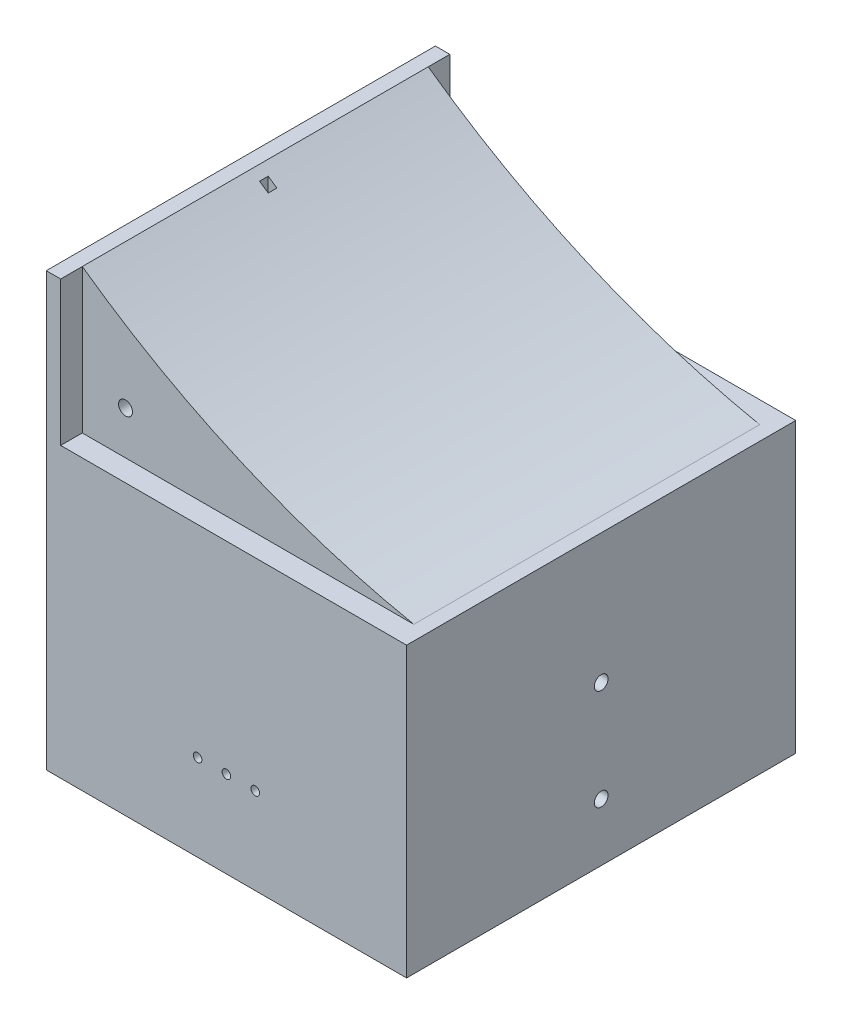
ISO-10303-21;
HEADER;
FILE_DESCRIPTION(('STEP AP214'),'2;1');
FILE_NAME('part.step','',(''),(''),'','','');
FILE_SCHEMA(('AUTOMOTIVE_DESIGN { 1 0 10303 214 1 1 1 1 }'));
ENDSEC;
DATA;
#1=APPLICATION_CONTEXT('core data for automotive mechanical design processes');
#2=APPLICATION_PROTOCOL_DEFINITION('international standard','automotive_design',2000,#1);
#3=PRODUCT_CONTEXT('',#1,'mechanical');
#4=PRODUCT('Part','Part','',(#3));
#5=PRODUCT_RELATED_PRODUCT_CATEGORY('part','',(#4));
#6=PRODUCT_DEFINITION_FORMATION('','',#4);
#7=PRODUCT_DEFINITION_CONTEXT('part definition',#1,'design');
#8=PRODUCT_DEFINITION('design','',#6,#7);
#9=PRODUCT_DEFINITION_SHAPE('','',#8);
#10=(LENGTH_UNIT() NAMED_UNIT(*) SI_UNIT(.MILLI.,.METRE.));
#11=(NAMED_UNIT(*) PLANE_ANGLE_UNIT() SI_UNIT($,.RADIAN.));
#12=(NAMED_UNIT(*) SI_UNIT($,.STERADIAN.) SOLID_ANGLE_UNIT());
#13=UNCERTAINTY_MEASURE_WITH_UNIT(LENGTH_MEASURE(1.E-05),#10,'distance_accuracy_value','');
#14=(GEOMETRIC_REPRESENTATION_CONTEXT(3) GLOBAL_UNCERTAINTY_ASSIGNED_CONTEXT((#13)) GLOBAL_UNIT_ASSIGNED_CONTEXT((#10,
#11,#12)) REPRESENTATION_CONTEXT('',''));
#15=CARTESIAN_POINT('',(0.,0.,0.));
#16=DIRECTION('',(0.,0.,1.));
#17=DIRECTION('',(1.,0.,0.));
#18=AXIS2_PLACEMENT_3D('',#15,#16,#17);
#19=CARTESIAN_POINT('',(0.,0.,60.));
#20=DIRECTION('',(0.,1.,0.));
#21=DIRECTION('',(0.,0.,1.));
#22=AXIS2_PLACEMENT_3D('',#19,#20,#21);
#23=PLANE('',#22);
#24=DIRECTION('',(0.,0.,1.));
#25=VECTOR('',#24,1.);
#26=CARTESIAN_POINT('',(-5.,0.,-67.5));
#27=LINE('',#26,#25);
#28=CARTESIAN_POINT('',(-5.,0.,37.5));
#29=VERTEX_POINT('',#28);
#30=CARTESIAN_POINT('',(-5.,0.,67.5));
#31=VERTEX_POINT('',#30);
#32=EDGE_CURVE('E296',#29,#31,#27,.T.);
#33=ORIENTED_EDGE('',*,*,#32,.F.);
#34=DIRECTION('',(-1.,0.,0.));
#35=VECTOR('',#34,1.);
#36=CARTESIAN_POINT('',(-5.,0.,37.5));
#37=LINE('',#36,#35);
#38=CARTESIAN_POINT('',(107.3,0.,37.5));
#39=VERTEX_POINT('',#38);
#40=EDGE_CURVE('E269',#39,#29,#37,.T.);
#41=ORIENTED_EDGE('',*,*,#40,.F.);
#42=DIRECTION('',(0.,0.,1.));
#43=VECTOR('',#42,1.);
#44=CARTESIAN_POINT('',(107.3,0.,37.5));
#45=LINE('',#44,#43);
#46=CARTESIAN_POINT('',(107.3,0.,-37.5));
#47=VERTEX_POINT('',#46);
#48=EDGE_CURVE('E280',#47,#39,#45,.T.);
#49=ORIENTED_EDGE('',*,*,#48,.F.);
#50=DIRECTION('',(1.,0.,0.));
#51=VECTOR('',#50,1.);
#52=CARTESIAN_POINT('',(-5.,0.,-37.5));
#53=LINE('',#52,#51);
#54=CARTESIAN_POINT('',(-5.,0.,-37.5));
#55=VERTEX_POINT('',#54);
#56=EDGE_CURVE('E264',#55,#47,#53,.T.);
#57=ORIENTED_EDGE('',*,*,#56,.F.);
#58=CARTESIAN_POINT('',(-5.,0.,-67.5));
#59=VERTEX_POINT('',#58);
#60=EDGE_CURVE('E298',#59,#55,#27,.T.);
#61=ORIENTED_EDGE('',*,*,#60,.F.);
#62=DIRECTION('',(1.,0.,0.));
#63=VECTOR('',#62,1.);
#64=CARTESIAN_POINT('',(0.,0.,-67.5));
#65=LINE('',#64,#63);
#66=CARTESIAN_POINT('',(120.,0.,-67.5));
#67=VERTEX_POINT('',#66);
#68=EDGE_CURVE('E324',#59,#67,#65,.T.);
#69=ORIENTED_EDGE('',*,*,#68,.T.);
#70=DIRECTION('',(0.,0.,-1.));
#71=VECTOR('',#70,1.);
#72=CARTESIAN_POINT('',(120.,0.,60.));
#73=LINE('',#72,#71);
#74=CARTESIAN_POINT('',(120.,0.,67.5));
#75=VERTEX_POINT('',#74);
#76=EDGE_CURVE('E44',#75,#67,#73,.T.);
#77=ORIENTED_EDGE('',*,*,#76,.F.);
#78=DIRECTION('',(1.,0.,0.));
#79=VECTOR('',#78,1.);
#80=CARTESIAN_POINT('',(0.,0.,67.5));
#81=LINE('',#80,#79);
#82=EDGE_CURVE('E330',#31,#75,#81,.T.);
#83=ORIENTED_EDGE('',*,*,#82,.F.);
#84=EDGE_LOOP('',(#33,#41,#49,#57,#61,#69,#77,#83));
#85=FACE_BOUND('',#84,.T.);
#86=ADVANCED_FACE('F41',(#85),#23,.F.);
#87=CARTESIAN_POINT('',(120.,0.,60.));
#88=DIRECTION('',(-1.,0.,0.));
#89=DIRECTION('',(0.,0.,1.));
#90=AXIS2_PLACEMENT_3D('',#87,#88,#89);
#91=PLANE('',#90);
#92=CARTESIAN_POINT('',(120.,55.,0.));
#93=DIRECTION('',(-1.,0.,0.));
#94=DIRECTION('',(0.,0.,1.));
#95=AXIS2_PLACEMENT_3D('',#92,#93,#94);
#96=CIRCLE('',#95,2.38759999999998);
#97=CARTESIAN_POINT('',(120.,55.,2.38759999999998));
#98=VERTEX_POINT('',#97);
#99=EDGE_CURVE('E255',#98,#98,#96,.T.);
#100=ORIENTED_EDGE('',*,*,#99,.T.);
#101=EDGE_LOOP('',(#100));
#102=FACE_BOUND('',#101,.T.);
#103=CARTESIAN_POINT('',(120.,20.,0.));
#104=DIRECTION('',(-1.,0.,0.));
#105=DIRECTION('',(0.,0.,1.));
#106=AXIS2_PLACEMENT_3D('',#103,#104,#105);
#107=CIRCLE('',#106,2.38759999999999);
#108=CARTESIAN_POINT('',(120.,20.,2.38759999999999));
#109=VERTEX_POINT('',#108);
#110=EDGE_CURVE('E261',#109,#109,#107,.T.);
#111=ORIENTED_EDGE('',*,*,#110,.T.);
#112=EDGE_LOOP('',(#111));
#113=FACE_BOUND('',#112,.T.);
#114=ORIENTED_EDGE('',*,*,#76,.T.);
#115=DIRECTION('',(0.,1.,0.));
#116=VECTOR('',#115,1.);
#117=CARTESIAN_POINT('',(120.,0.,-67.5));
#118=LINE('',#117,#116);
#119=CARTESIAN_POINT('',(120.,100.,-67.5));
#120=VERTEX_POINT('',#119);
#121=EDGE_CURVE('E321',#67,#120,#118,.T.);
#122=ORIENTED_EDGE('',*,*,#121,.T.);
#123=DIRECTION('',(0.,0.,-1.));
#124=VECTOR('',#123,1.);
#125=CARTESIAN_POINT('',(120.,100.,60.));
#126=LINE('',#125,#124);
#127=CARTESIAN_POINT('',(120.,100.,67.5));
#128=VERTEX_POINT('',#127);
#129=EDGE_CURVE('E359',#128,#120,#126,.T.);
#130=ORIENTED_EDGE('',*,*,#129,.F.);
#131=DIRECTION('',(0.,1.,0.));
#132=VECTOR('',#131,1.);
#133=CARTESIAN_POINT('',(120.,0.,67.5));
#134=LINE('',#133,#132);
#135=EDGE_CURVE('E333',#75,#128,#134,.T.);
#136=ORIENTED_EDGE('',*,*,#135,.F.);
#137=EDGE_LOOP('',(#114,#122,#130,#136));
#138=FACE_BOUND('',#137,.T.);
#139=ADVANCED_FACE('F366',(#102,#113,#138),#91,.F.);
#140=CARTESIAN_POINT('',(120.,100.,60.));
#141=DIRECTION('',(0.,-1.,0.));
#142=DIRECTION('',(0.,0.,-1.));
#143=AXIS2_PLACEMENT_3D('',#140,#141,#142);
#144=PLANE('',#143);
#145=ORIENTED_EDGE('',*,*,#129,.T.);
#146=DIRECTION('',(-1.,0.,0.));
#147=VECTOR('',#146,1.);
#148=CARTESIAN_POINT('',(0.,100.,-67.5));
#149=LINE('',#148,#147);
#150=CARTESIAN_POINT('',(0.,100.,-67.5));
#151=VERTEX_POINT('',#150);
#152=EDGE_CURVE('E318',#120,#151,#149,.T.);
#153=ORIENTED_EDGE('',*,*,#152,.T.);
#154=DIRECTION('',(0.,0.,1.));
#155=VECTOR('',#154,1.);
#156=CARTESIAN_POINT('',(0.,100.,-67.5));
#157=LINE('',#156,#155);
#158=CARTESIAN_POINT('',(0.,100.,-60.));
#159=VERTEX_POINT('',#158);
#160=EDGE_CURVE('E326',#151,#159,#157,.T.);
#161=ORIENTED_EDGE('',*,*,#160,.T.);
#162=DIRECTION('',(-1.,0.,0.));
#163=VECTOR('',#162,1.);
#164=CARTESIAN_POINT('',(0.,100.,-60.));
#165=LINE('',#164,#163);
#166=CARTESIAN_POINT('',(115.,100.,-60.));
#167=VERTEX_POINT('',#166);
#168=EDGE_CURVE('E12',#167,#159,#165,.T.);
#169=ORIENTED_EDGE('',*,*,#168,.F.);
#170=DIRECTION('',(0.,0.,-1.));
#171=VECTOR('',#170,1.);
#172=CARTESIAN_POINT('',(115.,100.,60.));
#173=LINE('',#172,#171);
#174=CARTESIAN_POINT('',(115.,100.,60.));
#175=VERTEX_POINT('',#174);
#176=EDGE_CURVE('E357',#175,#167,#173,.T.);
#177=ORIENTED_EDGE('',*,*,#176,.F.);
#178=DIRECTION('',(-1.,0.,0.));
#179=VECTOR('',#178,1.);
#180=CARTESIAN_POINT('',(0.,100.,60.));
#181=LINE('',#180,#179);
#182=CARTESIAN_POINT('',(0.,100.,60.));
#183=VERTEX_POINT('',#182);
#184=EDGE_CURVE('E49',#175,#183,#181,.T.);
#185=ORIENTED_EDGE('',*,*,#184,.T.);
#186=DIRECTION('',(0.,0.,-1.));
#187=VECTOR('',#186,1.);
#188=CARTESIAN_POINT('',(0.,100.,67.5));
#189=LINE('',#188,#187);
#190=CARTESIAN_POINT('',(0.,100.,67.5));
#191=VERTEX_POINT('',#190);
#192=EDGE_CURVE('E339',#191,#183,#189,.T.);
#193=ORIENTED_EDGE('',*,*,#192,.F.);
#194=DIRECTION('',(-1.,0.,0.));
#195=VECTOR('',#194,1.);
#196=CARTESIAN_POINT('',(0.,100.,67.5));
#197=LINE('',#196,#195);
#198=EDGE_CURVE('E336',#128,#191,#197,.T.);
#199=ORIENTED_EDGE('',*,*,#198,.F.);
#200=EDGE_LOOP('',(#145,#153,#161,#169,#177,#185,#193,#199));
#201=FACE_BOUND('',#200,.T.);
#202=ADVANCED_FACE('F387',(#201),#144,.F.);
#203=CARTESIAN_POINT('',(174.476177374421,394.045207961168,60.));
#204=DIRECTION('',(0.,0.,-1.));
#205=DIRECTION('',(-1.,0.,0.));
#206=AXIS2_PLACEMENT_3D('',#203,#204,#205);
#207=CYLINDRICAL_SURFACE('',#206,300.);
#208=CARTESIAN_POINT('',(174.476177374421,394.045207961168,1.50000000000005));
#209=DIRECTION('',(0.,0.,1.));
#210=DIRECTION('',(1.,0.,0.));
#211=AXIS2_PLACEMENT_3D('',#208,#209,#210);
#212=CIRCLE('',#211,300.);
#213=CARTESIAN_POINT('',(6.,145.819952079937,1.5));
#214=VERTEX_POINT('',#213);
#215=CARTESIAN_POINT('',(3.,147.882821327758,1.5));
#216=VERTEX_POINT('',#215);
#217=EDGE_CURVE('E210',#214,#216,#212,.F.);
#218=ORIENTED_EDGE('',*,*,#217,.T.);
#219=DIRECTION('',(0.,0.,-1.));
#220=VECTOR('',#219,1.);
#221=CARTESIAN_POINT('',(3.,147.882821327758,60.));
#222=LINE('',#221,#220);
#223=CARTESIAN_POINT('',(3.,147.882821327758,-1.5));
#224=VERTEX_POINT('',#223);
#225=EDGE_CURVE('E213',#216,#224,#222,.T.);
#226=ORIENTED_EDGE('',*,*,#225,.T.);
#227=CARTESIAN_POINT('',(174.476177374421,394.045207961168,-1.5));
#228=DIRECTION('',(0.,0.,-1.));
#229=DIRECTION('',(-1.,0.,0.));
#230=AXIS2_PLACEMENT_3D('',#227,#228,#229);
#231=CIRCLE('',#230,300.);
#232=CARTESIAN_POINT('',(6.00000000000001,145.819952079937,-1.5));
#233=VERTEX_POINT('',#232);
#234=EDGE_CURVE('E205',#224,#233,#231,.F.);
#235=ORIENTED_EDGE('',*,*,#234,.T.);
#236=DIRECTION('',(0.,0.,-1.));
#237=VECTOR('',#236,1.);
#238=CARTESIAN_POINT('',(5.99999999999998,145.819952079937,60.));
#239=LINE('',#238,#237);
#240=EDGE_CURVE('E185',#233,#214,#239,.F.);
#241=ORIENTED_EDGE('',*,*,#240,.T.);
#242=EDGE_LOOP('',(#218,#226,#235,#241));
#243=FACE_BOUND('',#242,.T.);
#244=CARTESIAN_POINT('',(174.476177374421,394.045207961168,-60.));
#245=DIRECTION('',(0.,0.,-1.));
#246=DIRECTION('',(1.,0.,0.));
#247=AXIS2_PLACEMENT_3D('',#244,#245,#246);
#248=CIRCLE('',#247,300.);
#249=CARTESIAN_POINT('',(0.,150.,-60.));
#250=VERTEX_POINT('',#249);
#251=EDGE_CURVE('E348',#167,#250,#248,.T.);
#252=ORIENTED_EDGE('',*,*,#251,.T.);
#253=DIRECTION('',(0.,0.,-1.));
#254=VECTOR('',#253,1.);
#255=CARTESIAN_POINT('',(0.,150.,60.));
#256=LINE('',#255,#254);
#257=CARTESIAN_POINT('',(0.,150.,60.));
#258=VERTEX_POINT('',#257);
#259=EDGE_CURVE('E351',#258,#250,#256,.T.);
#260=ORIENTED_EDGE('',*,*,#259,.F.);
#261=CARTESIAN_POINT('',(174.476177374421,394.045207961168,60.));
#262=DIRECTION('',(0.,0.,-1.));
#263=DIRECTION('',(1.,0.,0.));
#264=AXIS2_PLACEMENT_3D('',#261,#262,#263);
#265=CIRCLE('',#264,300.);
#266=EDGE_CURVE('E347',#175,#258,#265,.T.);
#267=ORIENTED_EDGE('',*,*,#266,.F.);
#268=ORIENTED_EDGE('',*,*,#176,.T.);
#269=EDGE_LOOP('',(#252,#260,#267,#268));
#270=FACE_BOUND('',#269,.T.);
#271=ADVANCED_FACE('F394',(#243,#270),#207,.F.);
#272=CARTESIAN_POINT('',(174.476177374421,394.045207961168,60.));
#273=DIRECTION('',(0.,0.,1.));
#274=DIRECTION('',(1.,0.,0.));
#275=AXIS2_PLACEMENT_3D('',#272,#273,#274);
#276=PLANE('',#275);
#277=CARTESIAN_POINT('',(15.,115.,60.));
#278=DIRECTION('',(0.,0.,1.));
#279=DIRECTION('',(1.,0.,0.));
#280=AXIS2_PLACEMENT_3D('',#277,#278,#279);
#281=CIRCLE('',#280,2.413);
#282=CARTESIAN_POINT('',(17.413,115.,60.));
#283=VERTEX_POINT('',#282);
#284=EDGE_CURVE('E222',#283,#283,#281,.T.);
#285=ORIENTED_EDGE('',*,*,#284,.F.);
#286=EDGE_LOOP('',(#285));
#287=FACE_BOUND('',#286,.T.);
#288=ORIENTED_EDGE('',*,*,#184,.F.);
#289=ORIENTED_EDGE('',*,*,#266,.T.);
#290=DIRECTION('',(0.,-1.,0.));
#291=VECTOR('',#290,1.);
#292=CARTESIAN_POINT('',(0.,0.,60.));
#293=LINE('',#292,#291);
#294=EDGE_CURVE('E344',#258,#183,#293,.T.);
#295=ORIENTED_EDGE('',*,*,#294,.T.);
#296=EDGE_LOOP('',(#288,#289,#295));
#297=FACE_BOUND('',#296,.T.);
#298=ADVANCED_FACE('F398',(#287,#297),#276,.T.);
#299=CARTESIAN_POINT('',(174.476177374421,394.045207961168,-60.));
#300=DIRECTION('',(0.,0.,1.));
#301=DIRECTION('',(1.,0.,0.));
#302=AXIS2_PLACEMENT_3D('',#299,#300,#301);
#303=PLANE('',#302);
#304=CARTESIAN_POINT('',(15.,115.,-60.));
#305=DIRECTION('',(0.,0.,-1.));
#306=DIRECTION('',(-1.,0.,0.));
#307=AXIS2_PLACEMENT_3D('',#304,#305,#306);
#308=CIRCLE('',#307,2.413);
#309=CARTESIAN_POINT('',(12.587,115.,-60.));
#310=VERTEX_POINT('',#309);
#311=EDGE_CURVE('E216',#310,#310,#308,.T.);
#312=ORIENTED_EDGE('',*,*,#311,.F.);
#313=EDGE_LOOP('',(#312));
#314=FACE_BOUND('',#313,.T.);
#315=ORIENTED_EDGE('',*,*,#251,.F.);
#316=ORIENTED_EDGE('',*,*,#168,.T.);
#317=DIRECTION('',(0.,-1.,0.));
#318=VECTOR('',#317,1.);
#319=CARTESIAN_POINT('',(0.,0.,-60.));
#320=LINE('',#319,#318);
#321=EDGE_CURVE('E343',#250,#159,#320,.T.);
#322=ORIENTED_EDGE('',*,*,#321,.F.);
#323=EDGE_LOOP('',(#315,#316,#322));
#324=FACE_BOUND('',#323,.T.);
#325=ADVANCED_FACE('F391',(#314,#324),#303,.F.);
#326=CARTESIAN_POINT('',(0.,0.,67.5));
#327=DIRECTION('',(0.,0.,-1.));
#328=DIRECTION('',(-1.,0.,0.));
#329=AXIS2_PLACEMENT_3D('',#326,#327,#328);
#330=PLANE('',#329);
#331=CARTESIAN_POINT('',(67.5,30.,67.5));
#332=DIRECTION('',(0.,0.,-1.));
#333=DIRECTION('',(-1.,0.,0.));
#334=AXIS2_PLACEMENT_3D('',#331,#332,#333);
#335=CIRCLE('',#334,1.5);
#336=CARTESIAN_POINT('',(66.,30.,67.5));
#337=VERTEX_POINT('',#336);
#338=EDGE_CURVE('E480',#337,#337,#335,.T.);
#339=ORIENTED_EDGE('',*,*,#338,.T.);
#340=EDGE_LOOP('',(#339));
#341=FACE_BOUND('',#340,.T.);
#342=CARTESIAN_POINT('',(57.5,30.,67.5));
#343=DIRECTION('',(0.,0.,-1.));
#344=DIRECTION('',(-1.,0.,0.));
#345=AXIS2_PLACEMENT_3D('',#342,#343,#344);
#346=CIRCLE('',#345,1.5);
#347=CARTESIAN_POINT('',(56.,30.,67.5));
#348=VERTEX_POINT('',#347);
#349=EDGE_CURVE('E884',#348,#348,#346,.T.);
#350=ORIENTED_EDGE('',*,*,#349,.T.);
#351=EDGE_LOOP('',(#350));
#352=FACE_BOUND('',#351,.T.);
#353=CARTESIAN_POINT('',(47.5,30.,67.5));
#354=DIRECTION('',(0.,0.,-1.));
#355=DIRECTION('',(-1.,0.,0.));
#356=AXIS2_PLACEMENT_3D('',#353,#354,#355);
#357=CIRCLE('',#356,1.5);
#358=CARTESIAN_POINT('',(46.,30.,67.5));
#359=VERTEX_POINT('',#358);
#360=EDGE_CURVE('E892',#359,#359,#357,.T.);
#361=ORIENTED_EDGE('',*,*,#360,.T.);
#362=EDGE_LOOP('',(#361));
#363=FACE_BOUND('',#362,.T.);
#364=ORIENTED_EDGE('',*,*,#198,.T.);
#365=DIRECTION('',(0.,1.,0.));
#366=VECTOR('',#365,1.);
#367=CARTESIAN_POINT('',(0.,0.,67.5));
#368=LINE('',#367,#366);
#369=CARTESIAN_POINT('',(0.,150.,67.5));
#370=VERTEX_POINT('',#369);
#371=EDGE_CURVE('E308',#191,#370,#368,.T.);
#372=ORIENTED_EDGE('',*,*,#371,.T.);
#373=DIRECTION('',(1.,0.,0.));
#374=VECTOR('',#373,1.);
#375=CARTESIAN_POINT('',(-5.,150.,67.5));
#376=LINE('',#375,#374);
#377=CARTESIAN_POINT('',(-5.,150.,67.5));
#378=VERTEX_POINT('',#377);
#379=EDGE_CURVE('E315',#378,#370,#376,.T.);
#380=ORIENTED_EDGE('',*,*,#379,.F.);
#381=DIRECTION('',(0.,1.,0.));
#382=VECTOR('',#381,1.);
#383=CARTESIAN_POINT('',(-5.,0.,67.5));
#384=LINE('',#383,#382);
#385=EDGE_CURVE('E301',#31,#378,#384,.T.);
#386=ORIENTED_EDGE('',*,*,#385,.F.);
#387=ORIENTED_EDGE('',*,*,#82,.T.);
#388=ORIENTED_EDGE('',*,*,#135,.T.);
#389=EDGE_LOOP('',(#364,#372,#380,#386,#387,#388));
#390=FACE_BOUND('',#389,.T.);
#391=ADVANCED_FACE('F406',(#341,#352,#363,#390),#330,.F.);
#392=CARTESIAN_POINT('',(0.,0.,-67.5));
#393=DIRECTION('',(0.,0.,1.));
#394=DIRECTION('',(-1.,0.,0.));
#395=AXIS2_PLACEMENT_3D('',#392,#393,#394);
#396=PLANE('',#395);
#397=ORIENTED_EDGE('',*,*,#68,.F.);
#398=DIRECTION('',(0.,-1.,0.));
#399=VECTOR('',#398,1.);
#400=CARTESIAN_POINT('',(-5.,0.,-67.5));
#401=LINE('',#400,#399);
#402=CARTESIAN_POINT('',(-5.,150.,-67.5));
#403=VERTEX_POINT('',#402);
#404=EDGE_CURVE('E293',#403,#59,#401,.T.);
#405=ORIENTED_EDGE('',*,*,#404,.F.);
#406=DIRECTION('',(1.,0.,0.));
#407=VECTOR('',#406,1.);
#408=CARTESIAN_POINT('',(-5.,150.,-67.5));
#409=LINE('',#408,#407);
#410=CARTESIAN_POINT('',(0.,150.,-67.5));
#411=VERTEX_POINT('',#410);
#412=EDGE_CURVE('E305',#403,#411,#409,.T.);
#413=ORIENTED_EDGE('',*,*,#412,.T.);
#414=DIRECTION('',(0.,-1.,0.));
#415=VECTOR('',#414,1.);
#416=CARTESIAN_POINT('',(0.,0.,-67.5));
#417=LINE('',#416,#415);
#418=EDGE_CURVE('E287',#411,#151,#417,.T.);
#419=ORIENTED_EDGE('',*,*,#418,.T.);
#420=ORIENTED_EDGE('',*,*,#152,.F.);
#421=ORIENTED_EDGE('',*,*,#121,.F.);
#422=EDGE_LOOP('',(#397,#405,#413,#419,#420,#421));
#423=FACE_BOUND('',#422,.T.);
#424=ADVANCED_FACE('F370',(#423),#396,.F.);
#425=CARTESIAN_POINT('',(0.,0.,0.));
#426=DIRECTION('',(1.,0.,0.));
#427=DIRECTION('',(0.,0.,-1.));
#428=AXIS2_PLACEMENT_3D('',#425,#426,#427);
#429=PLANE('',#428);
#430=DIRECTION('',(0.,0.,-1.));
#431=VECTOR('',#430,1.);
#432=CARTESIAN_POINT('',(0.,150.,-67.5));
#433=LINE('',#432,#431);
#434=EDGE_CURVE('E310',#250,#411,#433,.T.);
#435=ORIENTED_EDGE('',*,*,#434,.F.);
#436=ORIENTED_EDGE('',*,*,#321,.T.);
#437=ORIENTED_EDGE('',*,*,#160,.F.);
#438=ORIENTED_EDGE('',*,*,#418,.F.);
#439=EDGE_LOOP('',(#435,#436,#437,#438));
#440=FACE_BOUND('',#439,.T.);
#441=ADVANCED_FACE('F385',(#440),#429,.T.);
#442=CARTESIAN_POINT('',(-5.,150.,-67.5));
#443=DIRECTION('',(0.,-1.,0.));
#444=DIRECTION('',(0.,0.,-1.));
#445=AXIS2_PLACEMENT_3D('',#442,#443,#444);
#446=PLANE('',#445);
#447=EDGE_CURVE('E297',#370,#258,#433,.T.);
#448=ORIENTED_EDGE('',*,*,#447,.T.);
#449=ORIENTED_EDGE('',*,*,#259,.T.);
#450=ORIENTED_EDGE('',*,*,#434,.T.);
#451=ORIENTED_EDGE('',*,*,#412,.F.);
#452=DIRECTION('',(0.,0.,-1.));
#453=VECTOR('',#452,1.);
#454=CARTESIAN_POINT('',(-5.,150.,-67.5));
#455=LINE('',#454,#453);
#456=EDGE_CURVE('E303',#378,#403,#455,.T.);
#457=ORIENTED_EDGE('',*,*,#456,.F.);
#458=ORIENTED_EDGE('',*,*,#379,.T.);
#459=EDGE_LOOP('',(#448,#449,#450,#451,#457,#458));
#460=FACE_BOUND('',#459,.T.);
#461=ADVANCED_FACE('F402',(#460),#446,.F.);
#462=CARTESIAN_POINT('',(-5.,0.,0.));
#463=DIRECTION('',(1.,0.,0.));
#464=DIRECTION('',(0.,0.,-1.));
#465=AXIS2_PLACEMENT_3D('',#462,#463,#464);
#466=PLANE('',#465);
#467=DIRECTION('',(0.,0.,-1.));
#468=VECTOR('',#467,1.);
#469=CARTESIAN_POINT('',(-5.,75.,37.5));
#470=LINE('',#469,#468);
#471=CARTESIAN_POINT('',(-5.,75.,37.5));
#472=VERTEX_POINT('',#471);
#473=CARTESIAN_POINT('',(-5.,75.,-37.5));
#474=VERTEX_POINT('',#473);
#475=EDGE_CURVE('E265',#472,#474,#470,.T.);
#476=ORIENTED_EDGE('',*,*,#475,.F.);
#477=DIRECTION('',(0.,-1.,0.));
#478=VECTOR('',#477,1.);
#479=CARTESIAN_POINT('',(-5.,75.,37.5));
#480=LINE('',#479,#478);
#481=EDGE_CURVE('E284',#472,#29,#480,.T.);
#482=ORIENTED_EDGE('',*,*,#481,.T.);
#483=ORIENTED_EDGE('',*,*,#32,.T.);
#484=ORIENTED_EDGE('',*,*,#385,.T.);
#485=ORIENTED_EDGE('',*,*,#456,.T.);
#486=ORIENTED_EDGE('',*,*,#404,.T.);
#487=ORIENTED_EDGE('',*,*,#60,.T.);
#488=DIRECTION('',(0.,-1.,0.));
#489=VECTOR('',#488,1.);
#490=CARTESIAN_POINT('',(-5.,75.,-37.5));
#491=LINE('',#490,#489);
#492=EDGE_CURVE('E277',#474,#55,#491,.T.);
#493=ORIENTED_EDGE('',*,*,#492,.F.);
#494=EDGE_LOOP('',(#476,#482,#483,#484,#485,#486,#487,#493));
#495=FACE_BOUND('',#494,.T.);
#496=ADVANCED_FACE('F379',(#495),#466,.F.);
#497=ORIENTED_EDGE('',*,*,#371,.F.);
#498=ORIENTED_EDGE('',*,*,#192,.T.);
#499=ORIENTED_EDGE('',*,*,#294,.F.);
#500=ORIENTED_EDGE('',*,*,#447,.F.);
#501=EDGE_LOOP('',(#497,#498,#499,#500));
#502=FACE_BOUND('',#501,.T.);
#503=ADVANCED_FACE('F401',(#502),#429,.T.);
#504=CARTESIAN_POINT('',(-5.,75.,37.5));
#505=DIRECTION('',(0.,0.,1.));
#506=DIRECTION('',(1.,0.,0.));
#507=AXIS2_PLACEMENT_3D('',#504,#505,#506);
#508=PLANE('',#507);
#509=CARTESIAN_POINT('',(67.5,30.,37.5));
#510=DIRECTION('',(0.,0.,-1.));
#511=DIRECTION('',(-1.,0.,0.));
#512=AXIS2_PLACEMENT_3D('',#509,#510,#511);
#513=CIRCLE('',#512,2.50000000000001);
#514=CARTESIAN_POINT('',(65.,30.,37.5));
#515=VERTEX_POINT('',#514);
#516=EDGE_CURVE('E470',#515,#515,#513,.T.);
#517=ORIENTED_EDGE('',*,*,#516,.F.);
#518=EDGE_LOOP('',(#517));
#519=FACE_BOUND('',#518,.T.);
#520=CARTESIAN_POINT('',(57.5,30.,37.5));
#521=DIRECTION('',(0.,0.,-1.));
#522=DIRECTION('',(-1.,0.,0.));
#523=AXIS2_PLACEMENT_3D('',#520,#521,#522);
#524=CIRCLE('',#523,2.5);
#525=CARTESIAN_POINT('',(55.,30.,37.5));
#526=VERTEX_POINT('',#525);
#527=EDGE_CURVE('E474',#526,#526,#524,.T.);
#528=ORIENTED_EDGE('',*,*,#527,.F.);
#529=EDGE_LOOP('',(#528));
#530=FACE_BOUND('',#529,.T.);
#531=CARTESIAN_POINT('',(47.5,30.,37.5));
#532=DIRECTION('',(0.,0.,-1.));
#533=DIRECTION('',(-1.,0.,0.));
#534=AXIS2_PLACEMENT_3D('',#531,#532,#533);
#535=CIRCLE('',#534,2.5);
#536=CARTESIAN_POINT('',(45.,30.,37.5));
#537=VERTEX_POINT('',#536);
#538=EDGE_CURVE('E477',#537,#537,#535,.T.);
#539=ORIENTED_EDGE('',*,*,#538,.F.);
#540=EDGE_LOOP('',(#539));
#541=FACE_BOUND('',#540,.T.);
#542=ORIENTED_EDGE('',*,*,#40,.T.);
#543=ORIENTED_EDGE('',*,*,#481,.F.);
#544=DIRECTION('',(-1.,0.,0.));
#545=VECTOR('',#544,1.);
#546=CARTESIAN_POINT('',(-5.,75.,37.5));
#547=LINE('',#546,#545);
#548=CARTESIAN_POINT('',(107.3,75.,37.5));
#549=VERTEX_POINT('',#548);
#550=EDGE_CURVE('E275',#549,#472,#547,.T.);
#551=ORIENTED_EDGE('',*,*,#550,.F.);
#552=DIRECTION('',(0.,-1.,0.));
#553=VECTOR('',#552,1.);
#554=CARTESIAN_POINT('',(107.3,75.,37.5));
#555=LINE('',#554,#553);
#556=EDGE_CURVE('E288',#549,#39,#555,.T.);
#557=ORIENTED_EDGE('',*,*,#556,.T.);
#558=EDGE_LOOP('',(#542,#543,#551,#557));
#559=FACE_BOUND('',#558,.T.);
#560=ADVANCED_FACE('F411',(#519,#530,#541,#559),#508,.F.);
#561=CARTESIAN_POINT('',(107.3,75.,37.5));
#562=DIRECTION('',(1.,0.,0.));
#563=DIRECTION('',(0.,0.,-1.));
#564=AXIS2_PLACEMENT_3D('',#561,#562,#563);
#565=PLANE('',#564);
#566=CARTESIAN_POINT('',(107.3,55.,0.));
#567=DIRECTION('',(-1.,0.,0.));
#568=DIRECTION('',(0.,0.,1.));
#569=AXIS2_PLACEMENT_3D('',#566,#567,#568);
#570=CIRCLE('',#569,2.38759999999999);
#571=CARTESIAN_POINT('',(107.3,55.,2.38759999999999));
#572=VERTEX_POINT('',#571);
#573=EDGE_CURVE('E252',#572,#572,#570,.T.);
#574=ORIENTED_EDGE('',*,*,#573,.F.);
#575=EDGE_LOOP('',(#574));
#576=FACE_BOUND('',#575,.T.);
#577=CARTESIAN_POINT('',(107.3,20.,0.));
#578=DIRECTION('',(-1.,0.,0.));
#579=DIRECTION('',(0.,0.,1.));
#580=AXIS2_PLACEMENT_3D('',#577,#578,#579);
#581=CIRCLE('',#580,2.38759999999999);
#582=CARTESIAN_POINT('',(107.3,20.,2.38759999999999));
#583=VERTEX_POINT('',#582);
#584=EDGE_CURVE('E258',#583,#583,#581,.T.);
#585=ORIENTED_EDGE('',*,*,#584,.F.);
#586=EDGE_LOOP('',(#585));
#587=FACE_BOUND('',#586,.T.);
#588=ORIENTED_EDGE('',*,*,#48,.T.);
#589=ORIENTED_EDGE('',*,*,#556,.F.);
#590=DIRECTION('',(0.,0.,1.));
#591=VECTOR('',#590,1.);
#592=CARTESIAN_POINT('',(107.3,75.,37.5));
#593=LINE('',#592,#591);
#594=CARTESIAN_POINT('',(107.3,75.,-37.5));
#595=VERTEX_POINT('',#594);
#596=EDGE_CURVE('E272',#595,#549,#593,.T.);
#597=ORIENTED_EDGE('',*,*,#596,.F.);
#598=DIRECTION('',(0.,-1.,0.));
#599=VECTOR('',#598,1.);
#600=CARTESIAN_POINT('',(107.3,75.,-37.5));
#601=LINE('',#600,#599);
#602=EDGE_CURVE('E290',#595,#47,#601,.T.);
#603=ORIENTED_EDGE('',*,*,#602,.T.);
#604=EDGE_LOOP('',(#588,#589,#597,#603));
#605=FACE_BOUND('',#604,.T.);
#606=ADVANCED_FACE('F414',(#576,#587,#605),#565,.F.);
#607=CARTESIAN_POINT('',(-5.,75.,-37.5));
#608=DIRECTION('',(0.,0.,-1.));
#609=DIRECTION('',(-1.,0.,0.));
#610=AXIS2_PLACEMENT_3D('',#607,#608,#609);
#611=PLANE('',#610);
#612=ORIENTED_EDGE('',*,*,#56,.T.);
#613=ORIENTED_EDGE('',*,*,#602,.F.);
#614=DIRECTION('',(1.,0.,0.));
#615=VECTOR('',#614,1.);
#616=CARTESIAN_POINT('',(-5.,75.,-37.5));
#617=LINE('',#616,#615);
#618=EDGE_CURVE('E268',#474,#595,#617,.T.);
#619=ORIENTED_EDGE('',*,*,#618,.F.);
#620=ORIENTED_EDGE('',*,*,#492,.T.);
#621=EDGE_LOOP('',(#612,#613,#619,#620));
#622=FACE_BOUND('',#621,.T.);
#623=ADVANCED_FACE('F416',(#622),#611,.F.);
#624=CARTESIAN_POINT('',(0.,75.,0.));
#625=DIRECTION('',(0.,-1.,0.));
#626=DIRECTION('',(0.,0.,-1.));
#627=AXIS2_PLACEMENT_3D('',#624,#625,#626);
#628=PLANE('',#627);
#629=DIRECTION('',(0.,0.,-1.));
#630=VECTOR('',#629,1.);
#631=CARTESIAN_POINT('',(3.,75.,-1.5));
#632=LINE('',#631,#630);
#633=CARTESIAN_POINT('',(3.,75.,1.5));
#634=VERTEX_POINT('',#633);
#635=CARTESIAN_POINT('',(3.,75.,-1.5));
#636=VERTEX_POINT('',#635);
#637=EDGE_CURVE('E65',#634,#636,#632,.T.);
#638=ORIENTED_EDGE('',*,*,#637,.F.);
#639=DIRECTION('',(-1.,0.,0.));
#640=VECTOR('',#639,1.);
#641=CARTESIAN_POINT('',(3.,75.,1.5));
#642=LINE('',#641,#640);
#643=CARTESIAN_POINT('',(6.,75.,1.5));
#644=VERTEX_POINT('',#643);
#645=EDGE_CURVE('E198',#644,#634,#642,.T.);
#646=ORIENTED_EDGE('',*,*,#645,.F.);
#647=DIRECTION('',(0.,0.,1.));
#648=VECTOR('',#647,1.);
#649=CARTESIAN_POINT('',(6.,75.,-1.5));
#650=LINE('',#649,#648);
#651=CARTESIAN_POINT('',(6.,75.,-1.5));
#652=VERTEX_POINT('',#651);
#653=EDGE_CURVE('E182',#652,#644,#650,.T.);
#654=ORIENTED_EDGE('',*,*,#653,.F.);
#655=DIRECTION('',(1.,0.,0.));
#656=VECTOR('',#655,1.);
#657=CARTESIAN_POINT('',(3.,75.,-1.5));
#658=LINE('',#657,#656);
#659=EDGE_CURVE('E191',#636,#652,#658,.T.);
#660=ORIENTED_EDGE('',*,*,#659,.F.);
#661=EDGE_LOOP('',(#638,#646,#654,#660));
#662=FACE_BOUND('',#661,.T.);
#663=CARTESIAN_POINT('',(20.,75.,-18.5));
#664=DIRECTION('',(0.,-1.,0.));
#665=DIRECTION('',(0.,0.,-1.));
#666=AXIS2_PLACEMENT_3D('',#663,#664,#665);
#667=CIRCLE('',#666,1.016);
#668=CARTESIAN_POINT('',(20.,75.,-19.516));
#669=VERTEX_POINT('',#668);
#670=EDGE_CURVE('E228',#669,#669,#667,.T.);
#671=ORIENTED_EDGE('',*,*,#670,.F.);
#672=EDGE_LOOP('',(#671));
#673=FACE_BOUND('',#672,.T.);
#674=CARTESIAN_POINT('',(72.,75.,14.25));
#675=DIRECTION('',(0.,-1.,0.));
#676=DIRECTION('',(0.,0.,-1.));
#677=AXIS2_PLACEMENT_3D('',#674,#675,#676);
#678=CIRCLE('',#677,1.016);
#679=CARTESIAN_POINT('',(72.,75.,13.234));
#680=VERTEX_POINT('',#679);
#681=EDGE_CURVE('E234',#680,#680,#678,.T.);
#682=ORIENTED_EDGE('',*,*,#681,.F.);
#683=EDGE_LOOP('',(#682));
#684=FACE_BOUND('',#683,.T.);
#685=CARTESIAN_POINT('',(72.,75.,-13.75));
#686=DIRECTION('',(0.,-1.,0.));
#687=DIRECTION('',(0.,0.,-1.));
#688=AXIS2_PLACEMENT_3D('',#685,#686,#687);
#689=CIRCLE('',#688,1.016);
#690=CARTESIAN_POINT('',(72.,75.,-14.766));
#691=VERTEX_POINT('',#690);
#692=EDGE_CURVE('E240',#691,#691,#689,.T.);
#693=ORIENTED_EDGE('',*,*,#692,.F.);
#694=EDGE_LOOP('',(#693));
#695=FACE_BOUND('',#694,.T.);
#696=CARTESIAN_POINT('',(21.143,75.,29.5));
#697=DIRECTION('',(0.,-1.,0.));
#698=DIRECTION('',(0.,0.,-1.));
#699=AXIS2_PLACEMENT_3D('',#696,#697,#698);
#700=CIRCLE('',#699,1.016);
#701=CARTESIAN_POINT('',(21.143,75.,28.484));
#702=VERTEX_POINT('',#701);
#703=EDGE_CURVE('E246',#702,#702,#700,.T.);
#704=ORIENTED_EDGE('',*,*,#703,.F.);
#705=EDGE_LOOP('',(#704));
#706=FACE_BOUND('',#705,.T.);
#707=ORIENTED_EDGE('',*,*,#475,.T.);
#708=ORIENTED_EDGE('',*,*,#618,.T.);
#709=ORIENTED_EDGE('',*,*,#596,.T.);
#710=ORIENTED_EDGE('',*,*,#550,.T.);
#711=EDGE_LOOP('',(#707,#708,#709,#710));
#712=FACE_BOUND('',#711,.T.);
#713=ADVANCED_FACE('F195',(#662,#673,#684,#695,#706,#712),#628,.T.);
#714=CARTESIAN_POINT('',(107.3,20.,0.));
#715=DIRECTION('',(-1.,0.,0.));
#716=DIRECTION('',(0.,0.,1.));
#717=AXIS2_PLACEMENT_3D('',#714,#715,#716);
#718=CYLINDRICAL_SURFACE('',#717,2.38759999999999);
#719=ORIENTED_EDGE('',*,*,#110,.F.);
#720=EDGE_LOOP('',(#719));
#721=FACE_BOUND('',#720,.T.);
#722=ORIENTED_EDGE('',*,*,#584,.T.);
#723=EDGE_LOOP('',(#722));
#724=FACE_BOUND('',#723,.T.);
#725=ADVANCED_FACE('F419',(#721,#724),#718,.F.);
#726=CARTESIAN_POINT('',(107.3,55.,0.));
#727=DIRECTION('',(-1.,0.,0.));
#728=DIRECTION('',(0.,0.,1.));
#729=AXIS2_PLACEMENT_3D('',#726,#727,#728);
#730=CYLINDRICAL_SURFACE('',#729,2.38759999999999);
#731=ORIENTED_EDGE('',*,*,#99,.F.);
#732=EDGE_LOOP('',(#731));
#733=FACE_BOUND('',#732,.T.);
#734=ORIENTED_EDGE('',*,*,#573,.T.);
#735=EDGE_LOOP('',(#734));
#736=FACE_BOUND('',#735,.T.);
#737=ADVANCED_FACE('F425',(#733,#736),#730,.F.);
#738=CARTESIAN_POINT('',(21.143,81.35,29.5));
#739=DIRECTION('',(0.,-1.,0.));
#740=DIRECTION('',(0.,0.,-1.));
#741=AXIS2_PLACEMENT_3D('',#738,#739,#740);
#742=CONICAL_SURFACE('',#741,1.016,1.02974425867665);
#743=CARTESIAN_POINT('',(21.143,81.960474388932,29.5));
#744=VERTEX_POINT('',#743);
#745=VERTEX_LOOP('',#744);
#746=FACE_BOUND('',#745,.T.);
#747=CARTESIAN_POINT('',(21.143,81.35,29.5));
#748=DIRECTION('',(0.,-1.,0.));
#749=DIRECTION('',(0.,0.,-1.));
#750=AXIS2_PLACEMENT_3D('',#747,#748,#749);
#751=CIRCLE('',#750,1.016);
#752=CARTESIAN_POINT('',(21.143,81.35,28.484));
#753=VERTEX_POINT('',#752);
#754=EDGE_CURVE('E249',#753,#753,#751,.T.);
#755=ORIENTED_EDGE('',*,*,#754,.T.);
#756=EDGE_LOOP('',(#755));
#757=FACE_BOUND('',#756,.T.);
#758=ADVANCED_FACE('F580',(#746,#757),#742,.F.);
#759=CARTESIAN_POINT('',(21.143,75.,29.5));
#760=DIRECTION('',(0.,-1.,0.));
#761=DIRECTION('',(0.,0.,-1.));
#762=AXIS2_PLACEMENT_3D('',#759,#760,#761);
#763=CYLINDRICAL_SURFACE('',#762,1.016);
#764=ORIENTED_EDGE('',*,*,#754,.F.);
#765=EDGE_LOOP('',(#764));
#766=FACE_BOUND('',#765,.T.);
#767=ORIENTED_EDGE('',*,*,#703,.T.);
#768=EDGE_LOOP('',(#767));
#769=FACE_BOUND('',#768,.T.);
#770=ADVANCED_FACE('F576',(#766,#769),#763,.F.);
#771=CARTESIAN_POINT('',(72.,81.35,-13.75));
#772=DIRECTION('',(0.,-1.,0.));
#773=DIRECTION('',(0.,0.,-1.));
#774=AXIS2_PLACEMENT_3D('',#771,#772,#773);
#775=CONICAL_SURFACE('',#774,1.016,1.02974425867665);
#776=CARTESIAN_POINT('',(72.,81.960474388932,-13.75));
#777=VERTEX_POINT('',#776);
#778=VERTEX_LOOP('',#777);
#779=FACE_BOUND('',#778,.T.);
#780=CARTESIAN_POINT('',(72.,81.35,-13.75));
#781=DIRECTION('',(0.,-1.,0.));
#782=DIRECTION('',(0.,0.,-1.));
#783=AXIS2_PLACEMENT_3D('',#780,#781,#782);
#784=CIRCLE('',#783,1.016);
#785=CARTESIAN_POINT('',(72.,81.35,-14.766));
#786=VERTEX_POINT('',#785);
#787=EDGE_CURVE('E243',#786,#786,#784,.T.);
#788=ORIENTED_EDGE('',*,*,#787,.T.);
#789=EDGE_LOOP('',(#788));
#790=FACE_BOUND('',#789,.T.);
#791=ADVANCED_FACE('F572',(#779,#790),#775,.F.);
#792=CARTESIAN_POINT('',(72.,75.,-13.75));
#793=DIRECTION('',(0.,-1.,0.));
#794=DIRECTION('',(0.,0.,-1.));
#795=AXIS2_PLACEMENT_3D('',#792,#793,#794);
#796=CYLINDRICAL_SURFACE('',#795,1.016);
#797=ORIENTED_EDGE('',*,*,#787,.F.);
#798=EDGE_LOOP('',(#797));
#799=FACE_BOUND('',#798,.T.);
#800=ORIENTED_EDGE('',*,*,#692,.T.);
#801=EDGE_LOOP('',(#800));
#802=FACE_BOUND('',#801,.T.);
#803=ADVANCED_FACE('F568',(#799,#802),#796,.F.);
#804=CARTESIAN_POINT('',(72.,81.35,14.25));
#805=DIRECTION('',(0.,-1.,0.));
#806=DIRECTION('',(0.,0.,-1.));
#807=AXIS2_PLACEMENT_3D('',#804,#805,#806);
#808=CONICAL_SURFACE('',#807,1.016,1.02974425867665);
#809=CARTESIAN_POINT('',(72.,81.960474388932,14.25));
#810=VERTEX_POINT('',#809);
#811=VERTEX_LOOP('',#810);
#812=FACE_BOUND('',#811,.T.);
#813=CARTESIAN_POINT('',(72.,81.35,14.25));
#814=DIRECTION('',(0.,-1.,0.));
#815=DIRECTION('',(0.,0.,-1.));
#816=AXIS2_PLACEMENT_3D('',#813,#814,#815);
#817=CIRCLE('',#816,1.016);
#818=CARTESIAN_POINT('',(72.,81.35,13.234));
#819=VERTEX_POINT('',#818);
#820=EDGE_CURVE('E237',#819,#819,#817,.T.);
#821=ORIENTED_EDGE('',*,*,#820,.T.);
#822=EDGE_LOOP('',(#821));
#823=FACE_BOUND('',#822,.T.);
#824=ADVANCED_FACE('F564',(#812,#823),#808,.F.);
#825=CARTESIAN_POINT('',(72.,75.,14.25));
#826=DIRECTION('',(0.,-1.,0.));
#827=DIRECTION('',(0.,0.,-1.));
#828=AXIS2_PLACEMENT_3D('',#825,#826,#827);
#829=CYLINDRICAL_SURFACE('',#828,1.016);
#830=ORIENTED_EDGE('',*,*,#820,.F.);
#831=EDGE_LOOP('',(#830));
#832=FACE_BOUND('',#831,.T.);
#833=ORIENTED_EDGE('',*,*,#681,.T.);
#834=EDGE_LOOP('',(#833));
#835=FACE_BOUND('',#834,.T.);
#836=ADVANCED_FACE('F560',(#832,#835),#829,.F.);
#837=CARTESIAN_POINT('',(20.,81.35,-18.5));
#838=DIRECTION('',(0.,-1.,0.));
#839=DIRECTION('',(0.,0.,-1.));
#840=AXIS2_PLACEMENT_3D('',#837,#838,#839);
#841=CONICAL_SURFACE('',#840,1.016,1.02974425867665);
#842=CARTESIAN_POINT('',(20.,81.960474388932,-18.5));
#843=VERTEX_POINT('',#842);
#844=VERTEX_LOOP('',#843);
#845=FACE_BOUND('',#844,.T.);
#846=CARTESIAN_POINT('',(20.,81.35,-18.5));
#847=DIRECTION('',(0.,-1.,0.));
#848=DIRECTION('',(0.,0.,-1.));
#849=AXIS2_PLACEMENT_3D('',#846,#847,#848);
#850=CIRCLE('',#849,1.016);
#851=CARTESIAN_POINT('',(20.,81.35,-19.516));
#852=VERTEX_POINT('',#851);
#853=EDGE_CURVE('E231',#852,#852,#850,.T.);
#854=ORIENTED_EDGE('',*,*,#853,.T.);
#855=EDGE_LOOP('',(#854));
#856=FACE_BOUND('',#855,.T.);
#857=ADVANCED_FACE('F556',(#845,#856),#841,.F.);
#858=CARTESIAN_POINT('',(20.,75.,-18.5));
#859=DIRECTION('',(0.,-1.,0.));
#860=DIRECTION('',(0.,0.,-1.));
#861=AXIS2_PLACEMENT_3D('',#858,#859,#860);
#862=CYLINDRICAL_SURFACE('',#861,1.016);
#863=ORIENTED_EDGE('',*,*,#853,.F.);
#864=EDGE_LOOP('',(#863));
#865=FACE_BOUND('',#864,.T.);
#866=ORIENTED_EDGE('',*,*,#670,.T.);
#867=EDGE_LOOP('',(#866));
#868=FACE_BOUND('',#867,.T.);
#869=ADVANCED_FACE('F552',(#865,#868),#862,.F.);
#870=CARTESIAN_POINT('',(15.,115.,34.6));
#871=DIRECTION('',(0.,0.,1.));
#872=DIRECTION('',(1.,0.,0.));
#873=AXIS2_PLACEMENT_3D('',#870,#871,#872);
#874=CONICAL_SURFACE('',#873,2.41299999999999,1.02974425867665);
#875=CARTESIAN_POINT('',(15.,115.,33.1501233262865));
#876=VERTEX_POINT('',#875);
#877=VERTEX_LOOP('',#876);
#878=FACE_BOUND('',#877,.T.);
#879=CARTESIAN_POINT('',(15.,115.,34.6));
#880=DIRECTION('',(0.,0.,1.));
#881=DIRECTION('',(1.,0.,0.));
#882=AXIS2_PLACEMENT_3D('',#879,#880,#881);
#883=CIRCLE('',#882,2.41299999999999);
#884=CARTESIAN_POINT('',(17.413,115.,34.6));
#885=VERTEX_POINT('',#884);
#886=EDGE_CURVE('E225',#885,#885,#883,.T.);
#887=ORIENTED_EDGE('',*,*,#886,.T.);
#888=EDGE_LOOP('',(#887));
#889=FACE_BOUND('',#888,.T.);
#890=ADVANCED_FACE('F548',(#878,#889),#874,.F.);
#891=CARTESIAN_POINT('',(15.,115.,60.));
#892=DIRECTION('',(0.,0.,1.));
#893=DIRECTION('',(1.,0.,0.));
#894=AXIS2_PLACEMENT_3D('',#891,#892,#893);
#895=CYLINDRICAL_SURFACE('',#894,2.413);
#896=ORIENTED_EDGE('',*,*,#886,.F.);
#897=EDGE_LOOP('',(#896));
#898=FACE_BOUND('',#897,.T.);
#899=ORIENTED_EDGE('',*,*,#284,.T.);
#900=EDGE_LOOP('',(#899));
#901=FACE_BOUND('',#900,.T.);
#902=ADVANCED_FACE('F544',(#898,#901),#895,.F.);
#903=CARTESIAN_POINT('',(15.,115.,-34.6));
#904=DIRECTION('',(0.,0.,-1.));
#905=DIRECTION('',(-1.,0.,0.));
#906=AXIS2_PLACEMENT_3D('',#903,#904,#905);
#907=CONICAL_SURFACE('',#906,2.41299999999999,1.02974425867665);
#908=CARTESIAN_POINT('',(15.,115.,-33.1501233262865));
#909=VERTEX_POINT('',#908);
#910=VERTEX_LOOP('',#909);
#911=FACE_BOUND('',#910,.T.);
#912=CARTESIAN_POINT('',(15.,115.,-34.6));
#913=DIRECTION('',(0.,0.,-1.));
#914=DIRECTION('',(-1.,0.,0.));
#915=AXIS2_PLACEMENT_3D('',#912,#913,#914);
#916=CIRCLE('',#915,2.41299999999999);
#917=CARTESIAN_POINT('',(12.587,115.,-34.6));
#918=VERTEX_POINT('',#917);
#919=EDGE_CURVE('E219',#918,#918,#916,.T.);
#920=ORIENTED_EDGE('',*,*,#919,.T.);
#921=EDGE_LOOP('',(#920));
#922=FACE_BOUND('',#921,.T.);
#923=ADVANCED_FACE('F540',(#911,#922),#907,.F.);
#924=CARTESIAN_POINT('',(15.,115.,-60.));
#925=DIRECTION('',(0.,0.,-1.));
#926=DIRECTION('',(-1.,0.,0.));
#927=AXIS2_PLACEMENT_3D('',#924,#925,#926);
#928=CYLINDRICAL_SURFACE('',#927,2.413);
#929=ORIENTED_EDGE('',*,*,#919,.F.);
#930=EDGE_LOOP('',(#929));
#931=FACE_BOUND('',#930,.T.);
#932=ORIENTED_EDGE('',*,*,#311,.T.);
#933=EDGE_LOOP('',(#932));
#934=FACE_BOUND('',#933,.T.);
#935=ADVANCED_FACE('F537',(#931,#934),#928,.F.);
#936=CARTESIAN_POINT('',(3.,150.,-1.5));
#937=DIRECTION('',(-1.,0.,0.));
#938=DIRECTION('',(0.,0.,1.));
#939=AXIS2_PLACEMENT_3D('',#936,#937,#938);
#940=PLANE('',#939);
#941=DIRECTION('',(0.,-1.,0.));
#942=VECTOR('',#941,1.);
#943=CARTESIAN_POINT('',(3.,150.,1.5));
#944=LINE('',#943,#942);
#945=EDGE_CURVE('E203',#216,#634,#944,.T.);
#946=ORIENTED_EDGE('',*,*,#945,.T.);
#947=ORIENTED_EDGE('',*,*,#637,.T.);
#948=DIRECTION('',(0.,-1.,0.));
#949=VECTOR('',#948,1.);
#950=CARTESIAN_POINT('',(3.,150.,-1.5));
#951=LINE('',#950,#949);
#952=EDGE_CURVE('E188',#224,#636,#951,.T.);
#953=ORIENTED_EDGE('',*,*,#952,.F.);
#954=ORIENTED_EDGE('',*,*,#225,.F.);
#955=EDGE_LOOP('',(#946,#947,#953,#954));
#956=FACE_BOUND('',#955,.T.);
#957=ADVANCED_FACE('F529',(#956),#940,.F.);
#958=CARTESIAN_POINT('',(3.,150.,1.5));
#959=DIRECTION('',(0.,0.,1.));
#960=DIRECTION('',(1.,0.,0.));
#961=AXIS2_PLACEMENT_3D('',#958,#959,#960);
#962=PLANE('',#961);
#963=DIRECTION('',(0.,-1.,0.));
#964=VECTOR('',#963,1.);
#965=CARTESIAN_POINT('',(6.,150.,1.5));
#966=LINE('',#965,#964);
#967=EDGE_CURVE('E187',#214,#644,#966,.T.);
#968=ORIENTED_EDGE('',*,*,#967,.T.);
#969=ORIENTED_EDGE('',*,*,#645,.T.);
#970=ORIENTED_EDGE('',*,*,#945,.F.);
#971=ORIENTED_EDGE('',*,*,#217,.F.);
#972=EDGE_LOOP('',(#968,#969,#970,#971));
#973=FACE_BOUND('',#972,.T.);
#974=ADVANCED_FACE('F526',(#973),#962,.F.);
#975=CARTESIAN_POINT('',(6.,150.,-1.5));
#976=DIRECTION('',(1.,0.,0.));
#977=DIRECTION('',(0.,0.,-1.));
#978=AXIS2_PLACEMENT_3D('',#975,#976,#977);
#979=PLANE('',#978);
#980=DIRECTION('',(0.,-1.,0.));
#981=VECTOR('',#980,1.);
#982=CARTESIAN_POINT('',(6.,150.,-1.5));
#983=LINE('',#982,#981);
#984=EDGE_CURVE('E57',#233,#652,#983,.T.);
#985=ORIENTED_EDGE('',*,*,#984,.T.);
#986=ORIENTED_EDGE('',*,*,#653,.T.);
#987=ORIENTED_EDGE('',*,*,#967,.F.);
#988=ORIENTED_EDGE('',*,*,#240,.F.);
#989=EDGE_LOOP('',(#985,#986,#987,#988));
#990=FACE_BOUND('',#989,.T.);
#991=ADVANCED_FACE('F179',(#990),#979,.F.);
#992=CARTESIAN_POINT('',(3.,150.,-1.5));
#993=DIRECTION('',(0.,0.,-1.));
#994=DIRECTION('',(-1.,0.,0.));
#995=AXIS2_PLACEMENT_3D('',#992,#993,#994);
#996=PLANE('',#995);
#997=ORIENTED_EDGE('',*,*,#952,.T.);
#998=ORIENTED_EDGE('',*,*,#659,.T.);
#999=ORIENTED_EDGE('',*,*,#984,.F.);
#1000=ORIENTED_EDGE('',*,*,#234,.F.);
#1001=EDGE_LOOP('',(#997,#998,#999,#1000));
#1002=FACE_BOUND('',#1001,.T.);
#1003=ADVANCED_FACE('F192',(#1002),#996,.F.);
#1004=CARTESIAN_POINT('',(47.5,30.,74.5710678118655));
#1005=DIRECTION('',(0.,0.,-1.));
#1006=DIRECTION('',(-1.,0.,0.));
#1007=AXIS2_PLACEMENT_3D('',#1004,#1005,#1006);
#1008=CYLINDRICAL_SURFACE('',#1007,2.5);
#1009=CARTESIAN_POINT('',(47.5,30.,64.5));
#1010=DIRECTION('',(0.,0.,-1.));
#1011=DIRECTION('',(-1.,0.,0.));
#1012=AXIS2_PLACEMENT_3D('',#1009,#1010,#1011);
#1013=CIRCLE('',#1012,2.5);
#1014=CARTESIAN_POINT('',(45.,30.,64.5));
#1015=VERTEX_POINT('',#1014);
#1016=EDGE_CURVE('E479',#1015,#1015,#1013,.F.);
#1017=ORIENTED_EDGE('',*,*,#1016,.T.);
#1018=EDGE_LOOP('',(#1017));
#1019=FACE_BOUND('',#1018,.T.);
#1020=ORIENTED_EDGE('',*,*,#538,.T.);
#1021=EDGE_LOOP('',(#1020));
#1022=FACE_BOUND('',#1021,.T.);
#1023=ADVANCED_FACE('F521',(#1019,#1022),#1008,.F.);
#1024=CARTESIAN_POINT('',(0.,0.,64.5));
#1025=DIRECTION('',(0.,0.,-1.));
#1026=DIRECTION('',(-1.,0.,0.));
#1027=AXIS2_PLACEMENT_3D('',#1024,#1025,#1026);
#1028=PLANE('',#1027);
#1029=CARTESIAN_POINT('',(47.5,30.,64.5));
#1030=DIRECTION('',(0.,0.,-1.));
#1031=DIRECTION('',(-1.,0.,0.));
#1032=AXIS2_PLACEMENT_3D('',#1029,#1030,#1031);
#1033=CIRCLE('',#1032,1.5);
#1034=CARTESIAN_POINT('',(46.,30.,64.5));
#1035=VERTEX_POINT('',#1034);
#1036=EDGE_CURVE('E894',#1035,#1035,#1033,.T.);
#1037=ORIENTED_EDGE('',*,*,#1036,.F.);
#1038=EDGE_LOOP('',(#1037));
#1039=FACE_BOUND('',#1038,.T.);
#1040=ORIENTED_EDGE('',*,*,#1016,.F.);
#1041=EDGE_LOOP('',(#1040));
#1042=FACE_BOUND('',#1041,.T.);
#1043=ADVANCED_FACE('F514',(#1039,#1042),#1028,.T.);
#1044=CARTESIAN_POINT('',(57.5,30.,74.5710678118655));
#1045=DIRECTION('',(0.,0.,-1.));
#1046=DIRECTION('',(-1.,0.,0.));
#1047=AXIS2_PLACEMENT_3D('',#1044,#1045,#1046);
#1048=CYLINDRICAL_SURFACE('',#1047,2.5);
#1049=CARTESIAN_POINT('',(57.5,30.,64.5));
#1050=DIRECTION('',(0.,0.,-1.));
#1051=DIRECTION('',(-1.,0.,0.));
#1052=AXIS2_PLACEMENT_3D('',#1049,#1050,#1051);
#1053=CIRCLE('',#1052,2.5);
#1054=CARTESIAN_POINT('',(55.,30.,64.5));
#1055=VERTEX_POINT('',#1054);
#1056=EDGE_CURVE('E488',#1055,#1055,#1053,.F.);
#1057=ORIENTED_EDGE('',*,*,#1056,.T.);
#1058=EDGE_LOOP('',(#1057));
#1059=FACE_BOUND('',#1058,.T.);
#1060=ORIENTED_EDGE('',*,*,#527,.T.);
#1061=EDGE_LOOP('',(#1060));
#1062=FACE_BOUND('',#1061,.T.);
#1063=ADVANCED_FACE('F501',(#1059,#1062),#1048,.F.);
#1064=CARTESIAN_POINT('',(0.,0.,64.5));
#1065=DIRECTION('',(0.,0.,-1.));
#1066=DIRECTION('',(-1.,0.,0.));
#1067=AXIS2_PLACEMENT_3D('',#1064,#1065,#1066);
#1068=PLANE('',#1067);
#1069=CARTESIAN_POINT('',(57.5,30.,64.5));
#1070=DIRECTION('',(0.,0.,-1.));
#1071=DIRECTION('',(-1.,0.,0.));
#1072=AXIS2_PLACEMENT_3D('',#1069,#1070,#1071);
#1073=CIRCLE('',#1072,1.5);
#1074=CARTESIAN_POINT('',(56.,30.,64.5));
#1075=VERTEX_POINT('',#1074);
#1076=EDGE_CURVE('E887',#1075,#1075,#1073,.T.);
#1077=ORIENTED_EDGE('',*,*,#1076,.F.);
#1078=EDGE_LOOP('',(#1077));
#1079=FACE_BOUND('',#1078,.T.);
#1080=ORIENTED_EDGE('',*,*,#1056,.F.);
#1081=EDGE_LOOP('',(#1080));
#1082=FACE_BOUND('',#1081,.T.);
#1083=ADVANCED_FACE('F503',(#1079,#1082),#1068,.T.);
#1084=CARTESIAN_POINT('',(67.5,30.,74.5710678118655));
#1085=DIRECTION('',(0.,0.,-1.));
#1086=DIRECTION('',(-1.,0.,0.));
#1087=AXIS2_PLACEMENT_3D('',#1084,#1085,#1086);
#1088=CYLINDRICAL_SURFACE('',#1087,2.50000000000001);
#1089=CARTESIAN_POINT('',(67.5,30.,64.5));
#1090=DIRECTION('',(0.,0.,-1.));
#1091=DIRECTION('',(-1.,0.,0.));
#1092=AXIS2_PLACEMENT_3D('',#1089,#1090,#1091);
#1093=CIRCLE('',#1092,2.50000000000001);
#1094=CARTESIAN_POINT('',(65.,30.,64.5));
#1095=VERTEX_POINT('',#1094);
#1096=EDGE_CURVE('E490',#1095,#1095,#1093,.F.);
#1097=ORIENTED_EDGE('',*,*,#1096,.T.);
#1098=EDGE_LOOP('',(#1097));
#1099=FACE_BOUND('',#1098,.T.);
#1100=ORIENTED_EDGE('',*,*,#516,.T.);
#1101=EDGE_LOOP('',(#1100));
#1102=FACE_BOUND('',#1101,.T.);
#1103=ADVANCED_FACE('F505',(#1099,#1102),#1088,.F.);
#1104=CARTESIAN_POINT('',(0.,0.,64.5));
#1105=DIRECTION('',(0.,0.,-1.));
#1106=DIRECTION('',(-1.,0.,0.));
#1107=AXIS2_PLACEMENT_3D('',#1104,#1105,#1106);
#1108=PLANE('',#1107);
#1109=CARTESIAN_POINT('',(67.5,30.,64.5));
#1110=DIRECTION('',(0.,0.,-1.));
#1111=DIRECTION('',(-1.,0.,0.));
#1112=AXIS2_PLACEMENT_3D('',#1109,#1110,#1111);
#1113=CIRCLE('',#1112,1.5);
#1114=CARTESIAN_POINT('',(66.,30.,64.5));
#1115=VERTEX_POINT('',#1114);
#1116=EDGE_CURVE('E485',#1115,#1115,#1113,.T.);
#1117=ORIENTED_EDGE('',*,*,#1116,.F.);
#1118=EDGE_LOOP('',(#1117));
#1119=FACE_BOUND('',#1118,.T.);
#1120=ORIENTED_EDGE('',*,*,#1096,.F.);
#1121=EDGE_LOOP('',(#1120));
#1122=FACE_BOUND('',#1121,.T.);
#1123=ADVANCED_FACE('F512',(#1119,#1122),#1108,.T.);
#1124=CARTESIAN_POINT('',(47.5,30.,67.5));
#1125=DIRECTION('',(0.,0.,-1.));
#1126=DIRECTION('',(-1.,0.,0.));
#1127=AXIS2_PLACEMENT_3D('',#1124,#1125,#1126);
#1128=CYLINDRICAL_SURFACE('',#1127,1.5);
#1129=ORIENTED_EDGE('',*,*,#360,.F.);
#1130=EDGE_LOOP('',(#1129));
#1131=FACE_BOUND('',#1130,.T.);
#1132=ORIENTED_EDGE('',*,*,#1036,.T.);
#1133=EDGE_LOOP('',(#1132));
#1134=FACE_BOUND('',#1133,.T.);
#1135=ADVANCED_FACE('F847',(#1131,#1134),#1128,.F.);
#1136=CARTESIAN_POINT('',(57.5,30.,67.5));
#1137=DIRECTION('',(0.,0.,-1.));
#1138=DIRECTION('',(-1.,0.,0.));
#1139=AXIS2_PLACEMENT_3D('',#1136,#1137,#1138);
#1140=CYLINDRICAL_SURFACE('',#1139,1.5);
#1141=ORIENTED_EDGE('',*,*,#349,.F.);
#1142=EDGE_LOOP('',(#1141));
#1143=FACE_BOUND('',#1142,.T.);
#1144=ORIENTED_EDGE('',*,*,#1076,.T.);
#1145=EDGE_LOOP('',(#1144));
#1146=FACE_BOUND('',#1145,.T.);
#1147=ADVANCED_FACE('F853',(#1143,#1146),#1140,.F.);
#1148=CARTESIAN_POINT('',(67.5,30.,67.5));
#1149=DIRECTION('',(0.,0.,-1.));
#1150=DIRECTION('',(-1.,0.,0.));
#1151=AXIS2_PLACEMENT_3D('',#1148,#1149,#1150);
#1152=CYLINDRICAL_SURFACE('',#1151,1.5);
#1153=ORIENTED_EDGE('',*,*,#338,.F.);
#1154=EDGE_LOOP('',(#1153));
#1155=FACE_BOUND('',#1154,.T.);
#1156=ORIENTED_EDGE('',*,*,#1116,.T.);
#1157=EDGE_LOOP('',(#1156));
#1158=FACE_BOUND('',#1157,.T.);
#1159=ADVANCED_FACE('F861',(#1155,#1158),#1152,.F.);
#1160=CLOSED_SHELL('',(#86,#139,#202,#271,#298,#325,#391,#424,#441,#461,#496,#503,#560,#606,
#623,#713,#725,#737,#758,#770,#791,#803,#824,#836,#857,#869,#890,#902,#923,#935,#957,#974,#991,
#1003,#1023,#1043,#1063,#1083,#1103,#1123,#1135,#1147,#1159));
#1161=MANIFOLD_SOLID_BREP('B2',#1160);
#1162=ADVANCED_BREP_SHAPE_REPRESENTATION('',(#18,#1161),#14);
#1163=SHAPE_DEFINITION_REPRESENTATION(#9,#1162);
ENDSEC;
END-ISO-10303-21;
